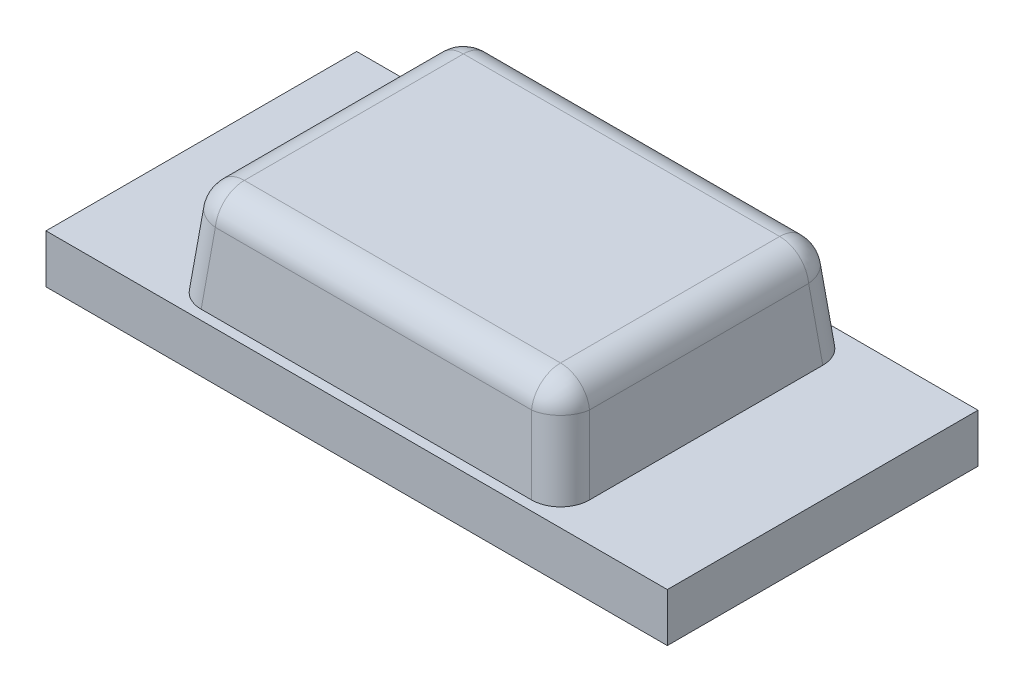
ISO-10303-21;
HEADER;
FILE_DESCRIPTION(('STEP AP214'),'2;1');
FILE_NAME('part.step','',(''),(''),'','','');
FILE_SCHEMA(('AUTOMOTIVE_DESIGN { 1 0 10303 214 1 1 1 1 }'));
ENDSEC;
DATA;
#1=APPLICATION_CONTEXT('core data for automotive mechanical design processes');
#2=APPLICATION_PROTOCOL_DEFINITION('international standard','automotive_design',2000,#1);
#3=PRODUCT_CONTEXT('',#1,'mechanical');
#4=PRODUCT('Part','Part','',(#3));
#5=PRODUCT_RELATED_PRODUCT_CATEGORY('part','',(#4));
#6=PRODUCT_DEFINITION_FORMATION('','',#4);
#7=PRODUCT_DEFINITION_CONTEXT('part definition',#1,'design');
#8=PRODUCT_DEFINITION('design','',#6,#7);
#9=PRODUCT_DEFINITION_SHAPE('','',#8);
#10=(LENGTH_UNIT() NAMED_UNIT(*) SI_UNIT(.MILLI.,.METRE.));
#11=(NAMED_UNIT(*) PLANE_ANGLE_UNIT() SI_UNIT($,.RADIAN.));
#12=(NAMED_UNIT(*) SI_UNIT($,.STERADIAN.) SOLID_ANGLE_UNIT());
#13=UNCERTAINTY_MEASURE_WITH_UNIT(LENGTH_MEASURE(1.E-05),#10,'distance_accuracy_value','');
#14=(GEOMETRIC_REPRESENTATION_CONTEXT(3) GLOBAL_UNCERTAINTY_ASSIGNED_CONTEXT((#13)) GLOBAL_UNIT_ASSIGNED_CONTEXT((#10,
#11,#12)) REPRESENTATION_CONTEXT('',''));
#15=CARTESIAN_POINT('',(0.,0.,0.));
#16=DIRECTION('',(0.,0.,1.));
#17=DIRECTION('',(1.,0.,0.));
#18=AXIS2_PLACEMENT_3D('',#15,#16,#17);
#19=CARTESIAN_POINT('',(-0.814255681,0.75,0.564255681));
#20=DIRECTION('',(0.,-1.,0.));
#21=DIRECTION('',(0.,0.,-1.));
#22=AXIS2_PLACEMENT_3D('',#19,#20,#21);
#23=PLANE('',#22);
#24=DIRECTION('',(-1.,0.,0.));
#25=VECTOR('',#24,1.);
#26=CARTESIAN_POINT('',(0.,0.75,0.564255680969235));
#27=LINE('',#26,#25);
#28=CARTESIAN_POINT('',(-0.814255681058048,0.749999999941955,0.56425568061731));
#29=VERTEX_POINT('',#28);
#30=CARTESIAN_POINT('',(0.814255680918878,0.750000000058046,0.564255680741093));
#31=VERTEX_POINT('',#30);
#32=EDGE_CURVE('E151',#29,#31,#27,.F.);
#33=ORIENTED_EDGE('',*,*,#32,.T.);
#34=DIRECTION('',(0.,0.,1.));
#35=VECTOR('',#34,1.);
#36=CARTESIAN_POINT('',(0.814255680969235,0.75,0.));
#37=LINE('',#36,#35);
#38=CARTESIAN_POINT('',(0.814255680984617,0.75,-0.564255681168272));
#39=VERTEX_POINT('',#38);
#40=EDGE_CURVE('E105',#31,#39,#37,.F.);
#41=ORIENTED_EDGE('',*,*,#40,.T.);
#42=DIRECTION('',(1.,0.,0.));
#43=VECTOR('',#42,1.);
#44=CARTESIAN_POINT('',(0.,0.75,-0.564255680969235));
#45=LINE('',#44,#43);
#46=CARTESIAN_POINT('',(-0.814255680934262,0.749999999941955,-0.56425568147571));
#47=VERTEX_POINT('',#46);
#48=EDGE_CURVE('E190',#39,#47,#45,.F.);
#49=ORIENTED_EDGE('',*,*,#48,.T.);
#50=DIRECTION('',(0.,0.,-1.));
#51=VECTOR('',#50,1.);
#52=CARTESIAN_POINT('',(-0.814255680969235,0.75,0.));
#53=LINE('',#52,#51);
#54=EDGE_CURVE('E162',#47,#29,#53,.F.);
#55=ORIENTED_EDGE('',*,*,#54,.T.);
#56=EDGE_LOOP('',(#33,#41,#49,#55));
#57=FACE_BOUND('',#56,.T.);
#58=ADVANCED_FACE('F16',(#57),#23,.F.);
#59=CARTESIAN_POINT('',(-1.6,0.,0.8));
#60=DIRECTION('',(0.,-1.,0.));
#61=DIRECTION('',(0.,0.,-1.));
#62=AXIS2_PLACEMENT_3D('',#59,#60,#61);
#63=PLANE('',#62);
#64=DIRECTION('',(0.,0.,-1.));
#65=VECTOR('',#64,1.);
#66=CARTESIAN_POINT('',(-1.6,0.,0.));
#67=LINE('',#66,#65);
#68=CARTESIAN_POINT('',(-1.6,0.,0.8));
#69=VERTEX_POINT('',#68);
#70=CARTESIAN_POINT('',(-1.6,0.,-0.8));
#71=VERTEX_POINT('',#70);
#72=EDGE_CURVE('E277',#69,#71,#67,.T.);
#73=ORIENTED_EDGE('',*,*,#72,.T.);
#74=DIRECTION('',(1.,0.,0.));
#75=VECTOR('',#74,1.);
#76=CARTESIAN_POINT('',(0.,0.,-0.8));
#77=LINE('',#76,#75);
#78=CARTESIAN_POINT('',(1.6,0.,-0.8));
#79=VERTEX_POINT('',#78);
#80=EDGE_CURVE('E271',#71,#79,#77,.T.);
#81=ORIENTED_EDGE('',*,*,#80,.T.);
#82=DIRECTION('',(0.,0.,1.));
#83=VECTOR('',#82,1.);
#84=CARTESIAN_POINT('',(1.6,0.,0.));
#85=LINE('',#84,#83);
#86=CARTESIAN_POINT('',(1.6,0.,0.8));
#87=VERTEX_POINT('',#86);
#88=EDGE_CURVE('E187',#79,#87,#85,.T.);
#89=ORIENTED_EDGE('',*,*,#88,.T.);
#90=DIRECTION('',(-1.,0.,0.));
#91=VECTOR('',#90,1.);
#92=CARTESIAN_POINT('',(0.,0.,0.8));
#93=LINE('',#92,#91);
#94=EDGE_CURVE('E104',#87,#69,#93,.T.);
#95=ORIENTED_EDGE('',*,*,#94,.T.);
#96=EDGE_LOOP('',(#73,#81,#89,#95));
#97=FACE_BOUND('',#96,.T.);
#98=ADVANCED_FACE('F180',(#97),#63,.T.);
#99=CARTESIAN_POINT('',(0.814255681232186,0.599999999767813,-0.564255681000003));
#100=DIRECTION('',(0.,-1.,0.));
#101=DIRECTION('',(0.,0.,-1.));
#102=AXIS2_PLACEMENT_3D('',#99,#100,#101);
#103=CIRCLE('',#102,0.15);
#104=TRIMMED_CURVE('',#103,(PARAMETER_VALUE(0.)),(PARAMETER_VALUE(3.14159265513768)),.T.,.PARAMETER.);
#105=CARTESIAN_POINT('',(0.814255681,0.6,-0.564255681));
#106=DIRECTION('',(0.,0.,1.));
#107=AXIS1_PLACEMENT('',#105,#106);
#108=SURFACE_OF_REVOLUTION('',#104,#107);
#109=CARTESIAN_POINT('',(0.814255681,0.6,-0.564255681));
#110=DIRECTION('',(1.,0.,0.));
#111=DIRECTION('',(0.,0.,-1.));
#112=AXIS2_PLACEMENT_3D('',#109,#110,#111);
#113=CIRCLE('',#112,0.15);
#114=CARTESIAN_POINT('',(0.814255680633374,0.614924012842646,-0.713511414020103));
#115=VERTEX_POINT('',#114);
#116=EDGE_CURVE('E101',#115,#39,#113,.T.);
#117=ORIENTED_EDGE('',*,*,#116,.T.);
#118=CARTESIAN_POINT('',(0.814255681,0.6,-0.564255681));
#119=DIRECTION('',(0.,0.,1.));
#120=DIRECTION('',(1.,0.,0.));
#121=AXIS2_PLACEMENT_3D('',#118,#119,#120);
#122=CIRCLE('',#121,0.15);
#123=CARTESIAN_POINT('',(0.96351141371124,0.614924015887899,-0.56425568128876));
#124=VERTEX_POINT('',#123);
#125=EDGE_CURVE('E97',#39,#124,#122,.F.);
#126=ORIENTED_EDGE('',*,*,#125,.T.);
#127=CARTESIAN_POINT('',(0.814255681158414,0.600000000306793,-0.564255681158414));
#128=DIRECTION('',(0.0990046045619691,-0.990149572817691,-0.0990046045619693));
#129=DIRECTION('',(0.,0.0994934181898311,-0.995038220239255));
#130=AXIS2_PLACEMENT_3D('',#127,#128,#129);
#131=CIRCLE('',#130,0.149999999935247);
#132=EDGE_CURVE('E20',#124,#115,#131,.F.);
#133=ORIENTED_EDGE('',*,*,#132,.T.);
#134=EDGE_LOOP('',(#117,#126,#133));
#135=FACE_BOUND('',#134,.T.);
#136=ADVANCED_FACE('F98',(#135),#108,.T.);
#137=CARTESIAN_POINT('',(-0.814255681,0.6,-0.564255681));
#138=DIRECTION('',(1.,0.,0.));
#139=DIRECTION('',(0.,1.,0.));
#140=AXIS2_PLACEMENT_3D('',#137,#138,#139);
#141=CYLINDRICAL_SURFACE('',#140,0.15);
#142=DIRECTION('',(1.,0.,0.));
#143=VECTOR('',#142,1.);
#144=CARTESIAN_POINT('',(0.,0.614924013,-0.713511414));
#145=LINE('',#144,#143);
#146=CARTESIAN_POINT('',(-0.814255680898972,0.614924011980278,-0.713511414326909));
#147=VERTEX_POINT('',#146);
#148=EDGE_CURVE('E88',#147,#115,#145,.T.);
#149=ORIENTED_EDGE('',*,*,#148,.F.);
#150=CARTESIAN_POINT('',(-0.814255680767813,0.599999999767819,-0.564255681464371));
#151=DIRECTION('',(1.,2.05103206470726E-10,0.));
#152=DIRECTION('',(0.,0.,-1.));
#153=AXIS2_PLACEMENT_3D('',#150,#151,#152);
#154=CIRCLE('',#153,0.15);
#155=EDGE_CURVE('E167',#147,#47,#154,.T.);
#156=ORIENTED_EDGE('',*,*,#155,.T.);
#157=ORIENTED_EDGE('',*,*,#48,.F.);
#158=ORIENTED_EDGE('',*,*,#116,.F.);
#159=EDGE_LOOP('',(#149,#156,#157,#158));
#160=FACE_BOUND('',#159,.T.);
#161=ADVANCED_FACE('F172',(#160),#141,.T.);
#162=CARTESIAN_POINT('',(-0.814255681232181,0.599999999767813,-0.564255681464371));
#163=DIRECTION('',(0.,-1.,0.));
#164=DIRECTION('',(0.,0.,-1.));
#165=AXIS2_PLACEMENT_3D('',#162,#163,#164);
#166=CIRCLE('',#165,0.15);
#167=TRIMMED_CURVE('',#166,(PARAMETER_VALUE(1.54786050643452E-09)),
(PARAMETER_VALUE(3.14159265204191)),.T.,.PARAMETER.);
#168=CARTESIAN_POINT('',(-0.814255681,0.6,-0.564255681));
#169=DIRECTION('',(0.,0.,1.));
#170=AXIS1_PLACEMENT('',#168,#169);
#171=SURFACE_OF_REVOLUTION('',#167,#170);
#172=CARTESIAN_POINT('',(-0.814255681338493,0.600000000342957,-0.564255681338493));
#173=DIRECTION('',(-0.0990046045609888,-0.990149572817887,-0.0990046045609883));
#174=DIRECTION('',(0.995038220239354,-0.0994934181888359,0.));
#175=AXIS2_PLACEMENT_3D('',#172,#173,#174);
#176=CIRCLE('',#175,0.149999999752651);
#177=CARTESIAN_POINT('',(-0.963511414083085,0.614924012877534,-0.564255681285929));
#178=VERTEX_POINT('',#177);
#179=EDGE_CURVE('E159',#147,#178,#176,.F.);
#180=ORIENTED_EDGE('',*,*,#179,.T.);
#181=CARTESIAN_POINT('',(-0.814255681,0.6,-0.564255681));
#182=DIRECTION('',(0.,0.,-1.));
#183=DIRECTION('',(-1.,0.,0.));
#184=AXIS2_PLACEMENT_3D('',#181,#182,#183);
#185=CIRCLE('',#184,0.15);
#186=EDGE_CURVE('E152',#178,#47,#185,.T.);
#187=ORIENTED_EDGE('',*,*,#186,.T.);
#188=ORIENTED_EDGE('',*,*,#155,.F.);
#189=EDGE_LOOP('',(#180,#187,#188));
#190=FACE_BOUND('',#189,.T.);
#191=ADVANCED_FACE('F169',(#190),#171,.T.);
#192=CARTESIAN_POINT('',(-0.814255681,0.6,0.564255681));
#193=DIRECTION('',(0.,0.,-1.));
#194=DIRECTION('',(-1.,0.,0.));
#195=AXIS2_PLACEMENT_3D('',#192,#193,#194);
#196=CYLINDRICAL_SURFACE('',#195,0.15);
#197=DIRECTION('',(0.,0.,-1.));
#198=VECTOR('',#197,1.);
#199=CARTESIAN_POINT('',(-0.963511414,0.614924013,0.));
#200=LINE('',#199,#198);
#201=CARTESIAN_POINT('',(-0.963511413796526,0.614924012631087,0.564255683016812));
#202=VERTEX_POINT('',#201);
#203=EDGE_CURVE('E155',#202,#178,#200,.T.);
#204=ORIENTED_EDGE('',*,*,#203,.F.);
#205=CARTESIAN_POINT('',(-0.814255681,0.6,0.56425567953077));
#206=DIRECTION('',(0.,0.,1.));
#207=DIRECTION('',(1.,1.54793351408977E-09,0.));
#208=AXIS2_PLACEMENT_3D('',#205,#206,#207);
#209=CIRCLE('',#208,0.149999999767819);
#210=EDGE_CURVE('E148',#202,#29,#209,.F.);
#211=ORIENTED_EDGE('',*,*,#210,.T.);
#212=ORIENTED_EDGE('',*,*,#54,.F.);
#213=ORIENTED_EDGE('',*,*,#186,.F.);
#214=EDGE_LOOP('',(#204,#211,#212,#213));
#215=FACE_BOUND('',#214,.T.);
#216=ADVANCED_FACE('F140',(#215),#196,.T.);
#217=CARTESIAN_POINT('',(-0.814255681232181,0.60000000023219,0.564255681000002));
#218=DIRECTION('',(0.,-1.,0.));
#219=DIRECTION('',(0.,0.,-1.));
#220=AXIS2_PLACEMENT_3D('',#217,#218,#219);
#221=CIRCLE('',#220,0.15);
#222=TRIMMED_CURVE('',#221,(PARAMETER_VALUE(1.54786050643452E-09)),
(PARAMETER_VALUE(3.14159265204191)),.T.,.PARAMETER.);
#223=CARTESIAN_POINT('',(-0.814255681,0.6,0.564255681));
#224=DIRECTION('',(0.,0.,1.));
#225=AXIS1_PLACEMENT('',#223,#224);
#226=SURFACE_OF_REVOLUTION('',#222,#225);
#227=CARTESIAN_POINT('',(-0.814255680755352,0.599999999675962,0.564255680755352));
#228=DIRECTION('',(-0.0990046045619691,-0.990149572817691,0.0990046045619691));
#229=DIRECTION('',(0.,-0.0994934181898309,-0.995038220239255));
#230=AXIS2_PLACEMENT_3D('',#227,#228,#229);
#231=CIRCLE('',#230,0.149999999533791);
#232=CARTESIAN_POINT('',(-0.814255683415363,0.614924012657866,0.713511413665788));
#233=VERTEX_POINT('',#232);
#234=EDGE_CURVE('E227',#202,#233,#231,.F.);
#235=ORIENTED_EDGE('',*,*,#234,.T.);
#236=CARTESIAN_POINT('',(-0.814255681,0.6,0.564255681));
#237=DIRECTION('',(-1.,0.,0.));
#238=DIRECTION('',(0.,0.,1.));
#239=AXIS2_PLACEMENT_3D('',#236,#237,#238);
#240=CIRCLE('',#239,0.15);
#241=EDGE_CURVE('E197',#233,#29,#240,.T.);
#242=ORIENTED_EDGE('',*,*,#241,.T.);
#243=ORIENTED_EDGE('',*,*,#210,.F.);
#244=EDGE_LOOP('',(#235,#242,#243));
#245=FACE_BOUND('',#244,.T.);
#246=ADVANCED_FACE('F135',(#245),#226,.T.);
#247=CARTESIAN_POINT('',(0.814255681,0.6,0.564255681));
#248=DIRECTION('',(-1.,0.,0.));
#249=DIRECTION('',(0.,-1.,0.));
#250=AXIS2_PLACEMENT_3D('',#247,#248,#249);
#251=CYLINDRICAL_SURFACE('',#250,0.15);
#252=DIRECTION('',(-1.,0.,0.));
#253=VECTOR('',#252,1.);
#254=CARTESIAN_POINT('',(0.,0.614924013,0.713511414));
#255=LINE('',#254,#253);
#256=CARTESIAN_POINT('',(0.814255683476164,0.614924012663885,0.713511413665186));
#257=VERTEX_POINT('',#256);
#258=EDGE_CURVE('E226',#257,#233,#255,.T.);
#259=ORIENTED_EDGE('',*,*,#258,.F.);
#260=CARTESIAN_POINT('',(0.81425568076781,0.600000000232186,0.564255681464368));
#261=DIRECTION('',(1.,2.05103206470726E-10,0.));
#262=DIRECTION('',(0.,0.,-1.));
#263=AXIS2_PLACEMENT_3D('',#260,#261,#262);
#264=CIRCLE('',#263,0.15);
#265=EDGE_CURVE('E117',#257,#31,#264,.F.);
#266=ORIENTED_EDGE('',*,*,#265,.T.);
#267=ORIENTED_EDGE('',*,*,#32,.F.);
#268=ORIENTED_EDGE('',*,*,#241,.F.);
#269=EDGE_LOOP('',(#259,#266,#267,#268));
#270=FACE_BOUND('',#269,.T.);
#271=ADVANCED_FACE('F130',(#270),#251,.T.);
#272=CARTESIAN_POINT('',(0.814255681232186,0.60000000023219,0.564255681464368));
#273=DIRECTION('',(0.,-1.,0.));
#274=DIRECTION('',(0.,0.,-1.));
#275=AXIS2_PLACEMENT_3D('',#272,#273,#274);
#276=CIRCLE('',#275,0.15);
#277=TRIMMED_CURVE('',#276,(PARAMETER_VALUE(0.)),(PARAMETER_VALUE(3.14159265513768)),.T.,.PARAMETER.);
#278=CARTESIAN_POINT('',(0.814255681,0.6,0.564255681));
#279=DIRECTION('',(0.,0.,1.));
#280=AXIS1_PLACEMENT('',#278,#279);
#281=SURFACE_OF_REVOLUTION('',#277,#280);
#282=CARTESIAN_POINT('',(0.814255681,0.6,0.564255681));
#283=DIRECTION('',(0.,0.,1.));
#284=DIRECTION('',(1.,0.,0.));
#285=AXIS2_PLACEMENT_3D('',#282,#283,#284);
#286=CIRCLE('',#285,0.15);
#287=CARTESIAN_POINT('',(0.963511413847012,0.614924012709589,0.564255683751427));
#288=VERTEX_POINT('',#287);
#289=EDGE_CURVE('E109',#288,#31,#286,.T.);
#290=ORIENTED_EDGE('',*,*,#289,.T.);
#291=ORIENTED_EDGE('',*,*,#265,.F.);
#292=CARTESIAN_POINT('',(0.814255680755352,0.599999999675962,0.564255680755352));
#293=DIRECTION('',(0.0990046045619691,-0.990149572817691,0.0990046045619691));
#294=DIRECTION('',(0.995038220239255,0.0994934181898309,0.));
#295=AXIS2_PLACEMENT_3D('',#292,#293,#294);
#296=CIRCLE('',#295,0.149999999533791);
#297=EDGE_CURVE('E94',#257,#288,#296,.F.);
#298=ORIENTED_EDGE('',*,*,#297,.T.);
#299=EDGE_LOOP('',(#290,#291,#298));
#300=FACE_BOUND('',#299,.T.);
#301=ADVANCED_FACE('F126',(#300),#281,.T.);
#302=CARTESIAN_POINT('',(0.814255681,0.6,-0.564255681));
#303=DIRECTION('',(0.,0.,1.));
#304=DIRECTION('',(1.,0.,0.));
#305=AXIS2_PLACEMENT_3D('',#302,#303,#304);
#306=CYLINDRICAL_SURFACE('',#305,0.15);
#307=ORIENTED_EDGE('',*,*,#40,.F.);
#308=ORIENTED_EDGE('',*,*,#289,.F.);
#309=DIRECTION('',(0.,0.,1.));
#310=VECTOR('',#309,1.);
#311=CARTESIAN_POINT('',(0.963511414,0.614924013,0.));
#312=LINE('',#311,#310);
#313=EDGE_CURVE('E92',#124,#288,#312,.T.);
#314=ORIENTED_EDGE('',*,*,#313,.F.);
#315=ORIENTED_EDGE('',*,*,#125,.F.);
#316=EDGE_LOOP('',(#307,#308,#314,#315));
#317=FACE_BOUND('',#316,.T.);
#318=ADVANCED_FACE('F107',(#317),#306,.T.);
#319=CARTESIAN_POINT('',(1.6,0.,0.8));
#320=DIRECTION('',(0.,0.,-1.));
#321=DIRECTION('',(-1.,0.,0.));
#322=AXIS2_PLACEMENT_3D('',#319,#320,#321);
#323=PLANE('',#322);
#324=DIRECTION('',(0.,1.,0.));
#325=VECTOR('',#324,1.);
#326=CARTESIAN_POINT('',(1.6,0.125,0.8));
#327=LINE('',#326,#325);
#328=CARTESIAN_POINT('',(1.6,0.25,0.8));
#329=VERTEX_POINT('',#328);
#330=EDGE_CURVE('E268',#87,#329,#327,.T.);
#331=ORIENTED_EDGE('',*,*,#330,.T.);
#332=DIRECTION('',(-1.,0.,0.));
#333=VECTOR('',#332,1.);
#334=CARTESIAN_POINT('',(0.,0.25,0.8));
#335=LINE('',#334,#333);
#336=CARTESIAN_POINT('',(-1.6,0.25,0.8));
#337=VERTEX_POINT('',#336);
#338=EDGE_CURVE('E111',#329,#337,#335,.T.);
#339=ORIENTED_EDGE('',*,*,#338,.T.);
#340=DIRECTION('',(0.,-1.,0.));
#341=VECTOR('',#340,1.);
#342=CARTESIAN_POINT('',(-1.6,0.125,0.8));
#343=LINE('',#342,#341);
#344=EDGE_CURVE('E279',#337,#69,#343,.T.);
#345=ORIENTED_EDGE('',*,*,#344,.T.);
#346=ORIENTED_EDGE('',*,*,#94,.F.);
#347=EDGE_LOOP('',(#331,#339,#345,#346));
#348=FACE_BOUND('',#347,.T.);
#349=ADVANCED_FACE('F319',(#348),#323,.F.);
#350=CARTESIAN_POINT('',(-1.6,0.,0.8));
#351=DIRECTION('',(1.,0.,0.));
#352=DIRECTION('',(0.,0.,-1.));
#353=AXIS2_PLACEMENT_3D('',#350,#351,#352);
#354=PLANE('',#353);
#355=ORIENTED_EDGE('',*,*,#344,.F.);
#356=DIRECTION('',(0.,0.,-1.));
#357=VECTOR('',#356,1.);
#358=CARTESIAN_POINT('',(-1.6,0.25,0.));
#359=LINE('',#358,#357);
#360=CARTESIAN_POINT('',(-1.6,0.25,-0.8));
#361=VERTEX_POINT('',#360);
#362=EDGE_CURVE('E303',#337,#361,#359,.T.);
#363=ORIENTED_EDGE('',*,*,#362,.T.);
#364=DIRECTION('',(0.,-1.,0.));
#365=VECTOR('',#364,1.);
#366=CARTESIAN_POINT('',(-1.6,0.125,-0.8));
#367=LINE('',#366,#365);
#368=EDGE_CURVE('E274',#361,#71,#367,.T.);
#369=ORIENTED_EDGE('',*,*,#368,.T.);
#370=ORIENTED_EDGE('',*,*,#72,.F.);
#371=EDGE_LOOP('',(#355,#363,#369,#370));
#372=FACE_BOUND('',#371,.T.);
#373=ADVANCED_FACE('F297',(#372),#354,.F.);
#374=CARTESIAN_POINT('',(-1.6,0.,-0.8));
#375=DIRECTION('',(0.,0.,1.));
#376=DIRECTION('',(1.,0.,0.));
#377=AXIS2_PLACEMENT_3D('',#374,#375,#376);
#378=PLANE('',#377);
#379=ORIENTED_EDGE('',*,*,#368,.F.);
#380=DIRECTION('',(1.,0.,0.));
#381=VECTOR('',#380,1.);
#382=CARTESIAN_POINT('',(0.,0.25,-0.8));
#383=LINE('',#382,#381);
#384=CARTESIAN_POINT('',(1.6,0.25,-0.8));
#385=VERTEX_POINT('',#384);
#386=EDGE_CURVE('E309',#361,#385,#383,.T.);
#387=ORIENTED_EDGE('',*,*,#386,.T.);
#388=DIRECTION('',(0.,-1.,0.));
#389=VECTOR('',#388,1.);
#390=CARTESIAN_POINT('',(1.6,0.125,-0.8));
#391=LINE('',#390,#389);
#392=EDGE_CURVE('E89',#385,#79,#391,.T.);
#393=ORIENTED_EDGE('',*,*,#392,.T.);
#394=ORIENTED_EDGE('',*,*,#80,.F.);
#395=EDGE_LOOP('',(#379,#387,#393,#394));
#396=FACE_BOUND('',#395,.T.);
#397=ADVANCED_FACE('F308',(#396),#378,.F.);
#398=CARTESIAN_POINT('',(1.6,0.,-0.8));
#399=DIRECTION('',(-1.,0.,0.));
#400=DIRECTION('',(0.,0.,1.));
#401=AXIS2_PLACEMENT_3D('',#398,#399,#400);
#402=PLANE('',#401);
#403=ORIENTED_EDGE('',*,*,#392,.F.);
#404=DIRECTION('',(0.,0.,1.));
#405=VECTOR('',#404,1.);
#406=CARTESIAN_POINT('',(1.6,0.25,0.));
#407=LINE('',#406,#405);
#408=EDGE_CURVE('E220',#385,#329,#407,.T.);
#409=ORIENTED_EDGE('',*,*,#408,.T.);
#410=ORIENTED_EDGE('',*,*,#330,.F.);
#411=ORIENTED_EDGE('',*,*,#88,.F.);
#412=EDGE_LOOP('',(#403,#409,#410,#411));
#413=FACE_BOUND('',#412,.T.);
#414=ADVANCED_FACE('F377',(#413),#402,.F.);
#415=CARTESIAN_POINT('',(0.814255681158414,0.600000000306793,-0.564255681158414));
#416=DIRECTION('',(0.0990046045619691,-0.990149572817691,-0.0990046045619693));
#417=DIRECTION('',(0.,0.0994934181898311,-0.995038220239255));
#418=AXIS2_PLACEMENT_3D('',#415,#416,#417);
#419=CYLINDRICAL_SURFACE('',#418,0.149999999935247);
#420=DIRECTION('',(0.0990046054971581,-0.990149572660435,-0.0990046051995037));
#421=VECTOR('',#420,1.);
#422=CARTESIAN_POINT('',(0.814255680266748,0.614924013,-0.713511414));
#423=LINE('',#422,#421);
#424=CARTESIAN_POINT('',(0.850744266648492,0.25,-0.749999999945995));
#425=VERTEX_POINT('',#424);
#426=EDGE_CURVE('E84',#115,#425,#423,.T.);
#427=ORIENTED_EDGE('',*,*,#426,.F.);
#428=ORIENTED_EDGE('',*,*,#132,.F.);
#429=DIRECTION('',(-0.0990046052310662,0.990149572976097,0.0990046023086504));
#430=VECTOR('',#429,1.);
#431=CARTESIAN_POINT('',(1.,0.25,-0.60074426650045));
#432=LINE('',#431,#430);
#433=CARTESIAN_POINT('',(0.999999999986633,0.249999999998663,-0.600744266762781));
#434=VERTEX_POINT('',#433);
#435=EDGE_CURVE('E83',#434,#124,#432,.T.);
#436=ORIENTED_EDGE('',*,*,#435,.F.);
#437=CARTESIAN_POINT('',(0.849252021689526,0.25,-0.599252021689526));
#438=DIRECTION('',(0.,-1.,0.));
#439=DIRECTION('',(0.707106781186547,0.,-0.707106781186548));
#440=AXIS2_PLACEMENT_3D('',#437,#438,#439);
#441=ELLIPSE('',#440,0.151492263444995,0.149999999935247);
#442=EDGE_CURVE('E219',#434,#425,#441,.F.);
#443=ORIENTED_EDGE('',*,*,#442,.T.);
#444=EDGE_LOOP('',(#427,#428,#436,#443));
#445=FACE_BOUND('',#444,.T.);
#446=ADVANCED_FACE('F81',(#445),#419,.T.);
#447=CARTESIAN_POINT('',(-0.860953198,0.25,-0.75));
#448=DIRECTION('',(0.,0.0994934188398162,-0.995038220174263));
#449=DIRECTION('',(0.,0.995038220174263,0.0994934188398162));
#450=AXIS2_PLACEMENT_3D('',#447,#448,#449);
#451=PLANE('',#450);
#452=ORIENTED_EDGE('',*,*,#148,.T.);
#453=ORIENTED_EDGE('',*,*,#426,.T.);
#454=DIRECTION('',(-1.,0.,0.));
#455=VECTOR('',#454,1.);
#456=CARTESIAN_POINT('',(0.,0.25,-0.75));
#457=LINE('',#456,#455);
#458=CARTESIAN_POINT('',(-0.850744267073968,0.25,-0.749999999955323));
#459=VERTEX_POINT('',#458);
#460=EDGE_CURVE('E218',#425,#459,#457,.T.);
#461=ORIENTED_EDGE('',*,*,#460,.T.);
#462=DIRECTION('',(-0.099004605252526,-0.990149572679594,-0.0990046052525263));
#463=VECTOR('',#462,1.);
#464=CARTESIAN_POINT('',(-0.832915133026806,0.428309982502654,-0.732170865999735));
#465=LINE('',#464,#463);
#466=EDGE_CURVE('E233',#459,#147,#465,.F.);
#467=ORIENTED_EDGE('',*,*,#466,.T.);
#468=EDGE_LOOP('',(#452,#453,#461,#467));
#469=FACE_BOUND('',#468,.T.);
#470=ADVANCED_FACE('F350',(#469),#451,.T.);
#471=CARTESIAN_POINT('',(-0.814255681338493,0.600000000342956,-0.564255681338493));
#472=DIRECTION('',(-0.0990046045609888,-0.990149572817887,-0.0990046045609883));
#473=DIRECTION('',(0.995038220239354,-0.0994934181888359,0.));
#474=AXIS2_PLACEMENT_3D('',#471,#472,#473);
#475=CYLINDRICAL_SURFACE('',#474,0.149999999752651);
#476=DIRECTION('',(-0.0990046052310662,-0.990149572976097,-0.0990046023086504));
#477=VECTOR('',#476,1.);
#478=CARTESIAN_POINT('',(-0.963511414,0.614924013,-0.564255681577519));
#479=LINE('',#478,#477);
#480=CARTESIAN_POINT('',(-0.999999999945905,0.25,-0.60074426680124));
#481=VERTEX_POINT('',#480);
#482=EDGE_CURVE('E158',#178,#481,#479,.T.);
#483=ORIENTED_EDGE('',*,*,#482,.F.);
#484=ORIENTED_EDGE('',*,*,#179,.F.);
#485=ORIENTED_EDGE('',*,*,#466,.F.);
#486=CARTESIAN_POINT('',(-0.849252021872867,0.25,-0.599252021872867));
#487=DIRECTION('',(0.,-1.,0.));
#488=DIRECTION('',(-0.707106781186549,0.,-0.707106781186546));
#489=AXIS2_PLACEMENT_3D('',#486,#487,#488);
#490=ELLIPSE('',#489,0.151492263260552,0.149999999752651);
#491=EDGE_CURVE('E215',#459,#481,#490,.F.);
#492=ORIENTED_EDGE('',*,*,#491,.T.);
#493=EDGE_LOOP('',(#483,#484,#485,#492));
#494=FACE_BOUND('',#493,.T.);
#495=ADVANCED_FACE('F354',(#494),#475,.T.);
#496=CARTESIAN_POINT('',(-0.963511414,0.614924013,-0.607953198));
#497=DIRECTION('',(-0.995038220174263,0.0994934188398159,0.));
#498=DIRECTION('',(-0.0994934188398159,-0.995038220174263,0.));
#499=AXIS2_PLACEMENT_3D('',#496,#497,#498);
#500=PLANE('',#499);
#501=DIRECTION('',(0.,0.,1.));
#502=VECTOR('',#501,1.);
#503=CARTESIAN_POINT('',(-1.,0.25,0.));
#504=LINE('',#503,#502);
#505=CARTESIAN_POINT('',(-0.999999999225994,0.249999999971483,0.600744266789597));
#506=VERTEX_POINT('',#505);
#507=EDGE_CURVE('E214',#481,#506,#504,.T.);
#508=ORIENTED_EDGE('',*,*,#507,.T.);
#509=DIRECTION('',(-0.099004603592526,-0.990149572819573,0.0990046055125915));
#510=VECTOR('',#509,1.);
#511=CARTESIAN_POINT('',(-0.98217086514332,0.428309982370828,0.582915133067153));
#512=LINE('',#511,#510);
#513=EDGE_CURVE('E230',#506,#202,#512,.F.);
#514=ORIENTED_EDGE('',*,*,#513,.T.);
#515=ORIENTED_EDGE('',*,*,#203,.T.);
#516=ORIENTED_EDGE('',*,*,#482,.T.);
#517=EDGE_LOOP('',(#508,#514,#515,#516));
#518=FACE_BOUND('',#517,.T.);
#519=ADVANCED_FACE('F257',(#518),#500,.T.);
#520=CARTESIAN_POINT('',(-0.814255680755352,0.599999999675962,0.564255680755352));
#521=DIRECTION('',(-0.0990046045619691,-0.990149572817691,0.0990046045619691));
#522=DIRECTION('',(0.,-0.0994934181898309,-0.995038220239255));
#523=AXIS2_PLACEMENT_3D('',#520,#521,#522);
#524=CYLINDRICAL_SURFACE('',#523,0.149999999533791);
#525=DIRECTION('',(-0.0990046054971572,-0.990149572660435,0.0990046051995037));
#526=VECTOR('',#525,1.);
#527=CARTESIAN_POINT('',(-0.814255680266748,0.614924013,0.713511414));
#528=LINE('',#527,#526);
#529=CARTESIAN_POINT('',(-0.850744266413426,0.25,0.749999999511198));
#530=VERTEX_POINT('',#529);
#531=EDGE_CURVE('E224',#233,#530,#528,.T.);
#532=ORIENTED_EDGE('',*,*,#531,.F.);
#533=ORIENTED_EDGE('',*,*,#234,.F.);
#534=ORIENTED_EDGE('',*,*,#513,.F.);
#535=CARTESIAN_POINT('',(-0.849252021223388,0.25,0.599252021223388));
#536=DIRECTION('',(0.,-1.,0.));
#537=DIRECTION('',(-0.707106781186547,0.,0.707106781186548));
#538=AXIS2_PLACEMENT_3D('',#535,#536,#537);
#539=ELLIPSE('',#538,0.151492263039545,0.149999999533791);
#540=EDGE_CURVE('E211',#506,#530,#539,.F.);
#541=ORIENTED_EDGE('',*,*,#540,.T.);
#542=EDGE_LOOP('',(#532,#533,#534,#541));
#543=FACE_BOUND('',#542,.T.);
#544=ADVANCED_FACE('F362',(#543),#524,.T.);
#545=CARTESIAN_POINT('',(-0.860953198,0.614924013,0.713511414));
#546=DIRECTION('',(0.,0.0994934188398162,0.995038220174263));
#547=DIRECTION('',(0.,-0.995038220174263,0.0994934188398162));
#548=AXIS2_PLACEMENT_3D('',#545,#546,#547);
#549=PLANE('',#548);
#550=ORIENTED_EDGE('',*,*,#258,.T.);
#551=ORIENTED_EDGE('',*,*,#531,.T.);
#552=DIRECTION('',(1.,0.,0.));
#553=VECTOR('',#552,1.);
#554=CARTESIAN_POINT('',(0.,0.25,0.75));
#555=LINE('',#554,#553);
#556=CARTESIAN_POINT('',(0.850744266123877,0.249999999971483,0.749999999225994));
#557=VERTEX_POINT('',#556);
#558=EDGE_CURVE('E210',#530,#557,#555,.T.);
#559=ORIENTED_EDGE('',*,*,#558,.T.);
#560=DIRECTION('',(0.0990046036113469,-0.990149573007796,0.0990046036113463));
#561=VECTOR('',#560,1.);
#562=CARTESIAN_POINT('',(0.832915132091147,0.428309982274204,0.732170865152982));
#563=LINE('',#562,#561);
#564=EDGE_CURVE('E223',#557,#257,#563,.F.);
#565=ORIENTED_EDGE('',*,*,#564,.T.);
#566=EDGE_LOOP('',(#550,#551,#559,#565));
#567=FACE_BOUND('',#566,.T.);
#568=ADVANCED_FACE('F340',(#567),#549,.T.);
#569=CARTESIAN_POINT('',(0.814255680755352,0.599999999675962,0.564255680755352));
#570=DIRECTION('',(0.0990046045619691,-0.990149572817691,0.0990046045619691));
#571=DIRECTION('',(0.995038220239255,0.0994934181898309,0.));
#572=AXIS2_PLACEMENT_3D('',#569,#570,#571);
#573=CYLINDRICAL_SURFACE('',#572,0.149999999533791);
#574=DIRECTION('',(0.0990046052310662,-0.990149572976097,0.0990046023086501));
#575=VECTOR('',#574,1.);
#576=CARTESIAN_POINT('',(0.963511414,0.614924013,0.564255681577519));
#577=LINE('',#576,#575);
#578=CARTESIAN_POINT('',(0.999999999511197,0.25,0.600744266475426));
#579=VERTEX_POINT('',#578);
#580=EDGE_CURVE('E34',#288,#579,#577,.T.);
#581=ORIENTED_EDGE('',*,*,#580,.F.);
#582=ORIENTED_EDGE('',*,*,#297,.F.);
#583=ORIENTED_EDGE('',*,*,#564,.F.);
#584=CARTESIAN_POINT('',(0.849252021223388,0.25,0.599252021223388));
#585=DIRECTION('',(0.,-1.,0.));
#586=DIRECTION('',(0.707106781186548,0.,0.707106781186547));
#587=AXIS2_PLACEMENT_3D('',#584,#585,#586);
#588=ELLIPSE('',#587,0.151492263039545,0.149999999533791);
#589=EDGE_CURVE('E26',#557,#579,#588,.F.);
#590=ORIENTED_EDGE('',*,*,#589,.T.);
#591=EDGE_LOOP('',(#581,#582,#583,#590));
#592=FACE_BOUND('',#591,.T.);
#593=ADVANCED_FACE('F345',(#592),#573,.T.);
#594=CARTESIAN_POINT('',(1.,0.25,-0.607953198));
#595=DIRECTION('',(0.995038220174263,0.0994934188398159,0.));
#596=DIRECTION('',(-0.0994934188398159,0.995038220174263,0.));
#597=AXIS2_PLACEMENT_3D('',#594,#595,#596);
#598=PLANE('',#597);
#599=ORIENTED_EDGE('',*,*,#313,.T.);
#600=ORIENTED_EDGE('',*,*,#580,.T.);
#601=DIRECTION('',(0.,0.,-1.));
#602=VECTOR('',#601,1.);
#603=CARTESIAN_POINT('',(1.,0.25,0.));
#604=LINE('',#603,#602);
#605=EDGE_CURVE('E11',#579,#434,#604,.T.);
#606=ORIENTED_EDGE('',*,*,#605,.T.);
#607=ORIENTED_EDGE('',*,*,#435,.T.);
#608=EDGE_LOOP('',(#599,#600,#606,#607));
#609=FACE_BOUND('',#608,.T.);
#610=ADVANCED_FACE('F90',(#609),#598,.T.);
#611=CARTESIAN_POINT('',(-1.6,0.25,0.8));
#612=DIRECTION('',(0.,-1.,0.));
#613=DIRECTION('',(0.,0.,-1.));
#614=AXIS2_PLACEMENT_3D('',#611,#612,#613);
#615=PLANE('',#614);
#616=ORIENTED_EDGE('',*,*,#589,.F.);
#617=ORIENTED_EDGE('',*,*,#558,.F.);
#618=ORIENTED_EDGE('',*,*,#540,.F.);
#619=ORIENTED_EDGE('',*,*,#507,.F.);
#620=ORIENTED_EDGE('',*,*,#491,.F.);
#621=ORIENTED_EDGE('',*,*,#460,.F.);
#622=ORIENTED_EDGE('',*,*,#442,.F.);
#623=ORIENTED_EDGE('',*,*,#605,.F.);
#624=EDGE_LOOP('',(#616,#617,#618,#619,#620,#621,#622,#623));
#625=FACE_BOUND('',#624,.T.);
#626=ORIENTED_EDGE('',*,*,#386,.F.);
#627=ORIENTED_EDGE('',*,*,#362,.F.);
#628=ORIENTED_EDGE('',*,*,#338,.F.);
#629=ORIENTED_EDGE('',*,*,#408,.F.);
#630=EDGE_LOOP('',(#626,#627,#628,#629));
#631=FACE_BOUND('',#630,.T.);
#632=ADVANCED_FACE('F18',(#625,#631),#615,.F.);
#633=CLOSED_SHELL('',(#58,#98,#136,#161,#191,#216,#246,#271,#301,#318,#349,#373,#397,#414,#446,
#470,#495,#519,#544,#568,#593,#610,#632));
#634=MANIFOLD_SOLID_BREP('B1',#633);
#635=ADVANCED_BREP_SHAPE_REPRESENTATION('',(#18,#634),#14);
#636=SHAPE_DEFINITION_REPRESENTATION(#9,#635);
ENDSEC;
END-ISO-10303-21;
